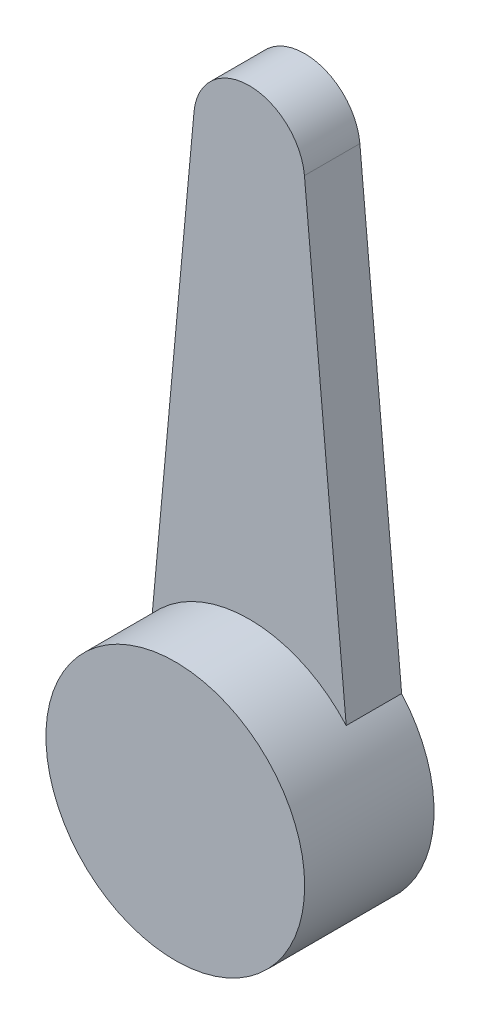
ISO-10303-21;
HEADER;
FILE_DESCRIPTION(('STEP AP214'),'2;1');
FILE_NAME('part.step','',(''),(''),'','','');
FILE_SCHEMA(('AUTOMOTIVE_DESIGN { 1 0 10303 214 1 1 1 1 }'));
ENDSEC;
DATA;
#1=APPLICATION_CONTEXT('core data for automotive mechanical design processes');
#2=APPLICATION_PROTOCOL_DEFINITION('international standard','automotive_design',2000,#1);
#3=PRODUCT_CONTEXT('',#1,'mechanical');
#4=PRODUCT('Part','Part','',(#3));
#5=PRODUCT_RELATED_PRODUCT_CATEGORY('part','',(#4));
#6=PRODUCT_DEFINITION_FORMATION('','',#4);
#7=PRODUCT_DEFINITION_CONTEXT('part definition',#1,'design');
#8=PRODUCT_DEFINITION('design','',#6,#7);
#9=PRODUCT_DEFINITION_SHAPE('','',#8);
#10=(LENGTH_UNIT() NAMED_UNIT(*) SI_UNIT(.MILLI.,.METRE.));
#11=(NAMED_UNIT(*) PLANE_ANGLE_UNIT() SI_UNIT($,.RADIAN.));
#12=(NAMED_UNIT(*) SI_UNIT($,.STERADIAN.) SOLID_ANGLE_UNIT());
#13=UNCERTAINTY_MEASURE_WITH_UNIT(LENGTH_MEASURE(1.E-05),#10,'distance_accuracy_value','');
#14=(GEOMETRIC_REPRESENTATION_CONTEXT(3) GLOBAL_UNCERTAINTY_ASSIGNED_CONTEXT((#13)) GLOBAL_UNIT_ASSIGNED_CONTEXT((#10,
#11,#12)) REPRESENTATION_CONTEXT('',''));
#15=CARTESIAN_POINT('',(0.,0.,0.));
#16=DIRECTION('',(0.,0.,1.));
#17=DIRECTION('',(1.,0.,0.));
#18=AXIS2_PLACEMENT_3D('',#15,#16,#17);
#19=CARTESIAN_POINT('',(0.,14.5,1.5));
#20=DIRECTION('',(0.,0.,-1.));
#21=DIRECTION('',(-1.,0.,0.));
#22=AXIS2_PLACEMENT_3D('',#19,#20,#21);
#23=CYLINDRICAL_SURFACE('',#22,1.5);
#24=CARTESIAN_POINT('',(0.,14.5,0.));
#25=DIRECTION('',(0.,0.,1.));
#26=DIRECTION('',(1.,0.,0.));
#27=AXIS2_PLACEMENT_3D('',#24,#25,#26);
#28=CIRCLE('',#27,1.5);
#29=CARTESIAN_POINT('',(1.49373125105343,14.6369925166801,0.));
#30=VERTEX_POINT('',#29);
#31=CARTESIAN_POINT('',(-1.49373125105343,14.6369925166801,0.));
#32=VERTEX_POINT('',#31);
#33=EDGE_CURVE('E131',#30,#32,#28,.T.);
#34=ORIENTED_EDGE('',*,*,#33,.T.);
#35=DIRECTION('',(0.,0.,-1.));
#36=VECTOR('',#35,1.);
#37=CARTESIAN_POINT('',(-1.49373125105343,14.6369925166801,1.5));
#38=LINE('',#37,#36);
#39=CARTESIAN_POINT('',(-1.49373125105343,14.6369925166801,1.5));
#40=VERTEX_POINT('',#39);
#41=EDGE_CURVE('E67',#40,#32,#38,.T.);
#42=ORIENTED_EDGE('',*,*,#41,.F.);
#43=CARTESIAN_POINT('',(0.,14.5,1.5));
#44=DIRECTION('',(0.,0.,1.));
#45=DIRECTION('',(1.,0.,0.));
#46=AXIS2_PLACEMENT_3D('',#43,#44,#45);
#47=CIRCLE('',#46,1.5);
#48=CARTESIAN_POINT('',(1.49373125105343,14.6369925166801,1.5));
#49=VERTEX_POINT('',#48);
#50=EDGE_CURVE('E107',#49,#40,#47,.T.);
#51=ORIENTED_EDGE('',*,*,#50,.F.);
#52=DIRECTION('',(0.,0.,-1.));
#53=VECTOR('',#52,1.);
#54=CARTESIAN_POINT('',(1.49373125105343,14.6369925166801,1.5));
#55=LINE('',#54,#53);
#56=EDGE_CURVE('E12',#49,#30,#55,.T.);
#57=ORIENTED_EDGE('',*,*,#56,.T.);
#58=EDGE_LOOP('',(#34,#42,#51,#57));
#59=FACE_BOUND('',#58,.T.);
#60=ADVANCED_FACE('F56',(#59),#23,.T.);
#61=CARTESIAN_POINT('',(-2.8124579391511,0.25793508093874,1.5));
#62=DIRECTION('',(0.995820834035623,-0.0913283444533893,0.));
#63=DIRECTION('',(0.0913283444533893,0.995820834035623,0.));
#64=AXIS2_PLACEMENT_3D('',#61,#62,#63);
#65=PLANE('',#64);
#66=DIRECTION('',(-0.0913283444533893,-0.995820834035623,0.));
#67=VECTOR('',#66,1.);
#68=CARTESIAN_POINT('',(-2.8124579391511,0.25793508093874,0.));
#69=LINE('',#68,#67);
#70=CARTESIAN_POINT('',(-2.62365881665993,2.31655226873098,0.));
#71=VERTEX_POINT('',#70);
#72=EDGE_CURVE('E108',#32,#71,#69,.T.);
#73=ORIENTED_EDGE('',*,*,#72,.T.);
#74=DIRECTION('',(0.,0.,-1.));
#75=VECTOR('',#74,1.);
#76=CARTESIAN_POINT('',(-2.62365881665993,2.31655226873098,1.5));
#77=LINE('',#76,#75);
#78=CARTESIAN_POINT('',(-2.62365881665993,2.31655226873098,1.5));
#79=VERTEX_POINT('',#78);
#80=EDGE_CURVE('E75',#79,#71,#77,.T.);
#81=ORIENTED_EDGE('',*,*,#80,.F.);
#82=DIRECTION('',(-0.0913283444533893,-0.995820834035623,0.));
#83=VECTOR('',#82,1.);
#84=CARTESIAN_POINT('',(-2.8124579391511,0.25793508093874,1.5));
#85=LINE('',#84,#83);
#86=EDGE_CURVE('E114',#40,#79,#85,.T.);
#87=ORIENTED_EDGE('',*,*,#86,.F.);
#88=ORIENTED_EDGE('',*,*,#41,.T.);
#89=EDGE_LOOP('',(#73,#81,#87,#88));
#90=FACE_BOUND('',#89,.T.);
#91=ADVANCED_FACE('F142',(#90),#65,.F.);
#92=CARTESIAN_POINT('',(2.8124579391511,0.25793508093874,1.5));
#93=DIRECTION('',(0.995820834035623,0.0913283444533893,0.));
#94=DIRECTION('',(-0.0913283444533893,0.995820834035623,0.));
#95=AXIS2_PLACEMENT_3D('',#92,#93,#94);
#96=PLANE('',#95);
#97=DIRECTION('',(0.0913283444533893,-0.995820834035623,0.));
#98=VECTOR('',#97,1.);
#99=CARTESIAN_POINT('',(2.8124579391511,0.25793508093874,0.));
#100=LINE('',#99,#98);
#101=CARTESIAN_POINT('',(2.62365881665993,2.31655226873098,0.));
#102=VERTEX_POINT('',#101);
#103=EDGE_CURVE('E128',#30,#102,#100,.T.);
#104=ORIENTED_EDGE('',*,*,#103,.F.);
#105=ORIENTED_EDGE('',*,*,#56,.F.);
#106=DIRECTION('',(0.0913283444533893,-0.995820834035623,0.));
#107=VECTOR('',#106,1.);
#108=CARTESIAN_POINT('',(2.8124579391511,0.25793508093874,1.5));
#109=LINE('',#108,#107);
#110=CARTESIAN_POINT('',(2.62365881665993,2.31655226873098,1.5));
#111=VERTEX_POINT('',#110);
#112=EDGE_CURVE('E102',#49,#111,#109,.T.);
#113=ORIENTED_EDGE('',*,*,#112,.T.);
#114=DIRECTION('',(0.,0.,-1.));
#115=VECTOR('',#114,1.);
#116=CARTESIAN_POINT('',(2.62365881665993,2.31655226873098,1.5));
#117=LINE('',#116,#115);
#118=EDGE_CURVE('E97',#111,#102,#117,.T.);
#119=ORIENTED_EDGE('',*,*,#118,.T.);
#120=EDGE_LOOP('',(#104,#105,#113,#119));
#121=FACE_BOUND('',#120,.T.);
#122=ADVANCED_FACE('F103',(#121),#96,.T.);
#123=CARTESIAN_POINT('',(0.,0.,0.));
#124=DIRECTION('',(0.,0.,1.));
#125=DIRECTION('',(1.,0.,0.));
#126=AXIS2_PLACEMENT_3D('',#123,#124,#125);
#127=PLANE('',#126);
#128=ORIENTED_EDGE('',*,*,#103,.T.);
#129=CARTESIAN_POINT('',(0.,0.,0.));
#130=DIRECTION('',(0.,0.,1.));
#131=DIRECTION('',(1.,0.,0.));
#132=AXIS2_PLACEMENT_3D('',#129,#130,#131);
#133=CIRCLE('',#132,3.5);
#134=EDGE_CURVE('E60',#71,#102,#133,.T.);
#135=ORIENTED_EDGE('',*,*,#134,.F.);
#136=ORIENTED_EDGE('',*,*,#72,.F.);
#137=ORIENTED_EDGE('',*,*,#33,.F.);
#138=EDGE_LOOP('',(#128,#135,#136,#137));
#139=FACE_BOUND('',#138,.T.);
#140=ADVANCED_FACE('F146',(#139),#127,.F.);
#141=CARTESIAN_POINT('',(0.,0.,1.5));
#142=DIRECTION('',(0.,0.,1.));
#143=DIRECTION('',(1.,0.,0.));
#144=AXIS2_PLACEMENT_3D('',#141,#142,#143);
#145=PLANE('',#144);
#146=CARTESIAN_POINT('',(0.,0.,1.5));
#147=DIRECTION('',(0.,0.,1.));
#148=DIRECTION('',(1.,0.,0.));
#149=AXIS2_PLACEMENT_3D('',#146,#147,#148);
#150=CIRCLE('',#149,3.5);
#151=EDGE_CURVE('E111',#111,#79,#150,.T.);
#152=ORIENTED_EDGE('',*,*,#151,.F.);
#153=ORIENTED_EDGE('',*,*,#112,.F.);
#154=ORIENTED_EDGE('',*,*,#50,.T.);
#155=ORIENTED_EDGE('',*,*,#86,.T.);
#156=EDGE_LOOP('',(#152,#153,#154,#155));
#157=FACE_BOUND('',#156,.T.);
#158=ADVANCED_FACE('F116',(#157),#145,.T.);
#159=CARTESIAN_POINT('',(0.,0.,1.5));
#160=DIRECTION('',(0.,0.,-1.));
#161=DIRECTION('',(-1.,0.,0.));
#162=AXIS2_PLACEMENT_3D('',#159,#160,#161);
#163=CYLINDRICAL_SURFACE('',#162,3.5);
#164=ORIENTED_EDGE('',*,*,#118,.F.);
#165=ORIENTED_EDGE('',*,*,#151,.T.);
#166=ORIENTED_EDGE('',*,*,#80,.T.);
#167=ORIENTED_EDGE('',*,*,#134,.T.);
#168=EDGE_LOOP('',(#164,#165,#166,#167));
#169=FACE_BOUND('',#168,.T.);
#170=CARTESIAN_POINT('',(0.,0.,3.5));
#171=DIRECTION('',(0.,0.,1.));
#172=DIRECTION('',(1.,0.,0.));
#173=AXIS2_PLACEMENT_3D('',#170,#171,#172);
#174=CIRCLE('',#173,3.5);
#175=CARTESIAN_POINT('',(3.5,0.,3.5));
#176=VERTEX_POINT('',#175);
#177=EDGE_CURVE('E118',#176,#176,#174,.T.);
#178=ORIENTED_EDGE('',*,*,#177,.F.);
#179=EDGE_LOOP('',(#178));
#180=FACE_BOUND('',#179,.T.);
#181=ADVANCED_FACE('F58',(#169,#180),#163,.T.);
#182=CARTESIAN_POINT('',(0.,0.,3.5));
#183=DIRECTION('',(0.,0.,1.));
#184=DIRECTION('',(1.,0.,0.));
#185=AXIS2_PLACEMENT_3D('',#182,#183,#184);
#186=PLANE('',#185);
#187=ORIENTED_EDGE('',*,*,#177,.T.);
#188=EDGE_LOOP('',(#187));
#189=FACE_BOUND('',#188,.T.);
#190=ADVANCED_FACE('F164',(#189),#186,.T.);
#191=CLOSED_SHELL('',(#60,#91,#122,#140,#158,#181,#190));
#192=MANIFOLD_SOLID_BREP('B2',#191);
#193=ADVANCED_BREP_SHAPE_REPRESENTATION('',(#18,#192),#14);
#194=SHAPE_DEFINITION_REPRESENTATION(#9,#193);
ENDSEC;
END-ISO-10303-21;
